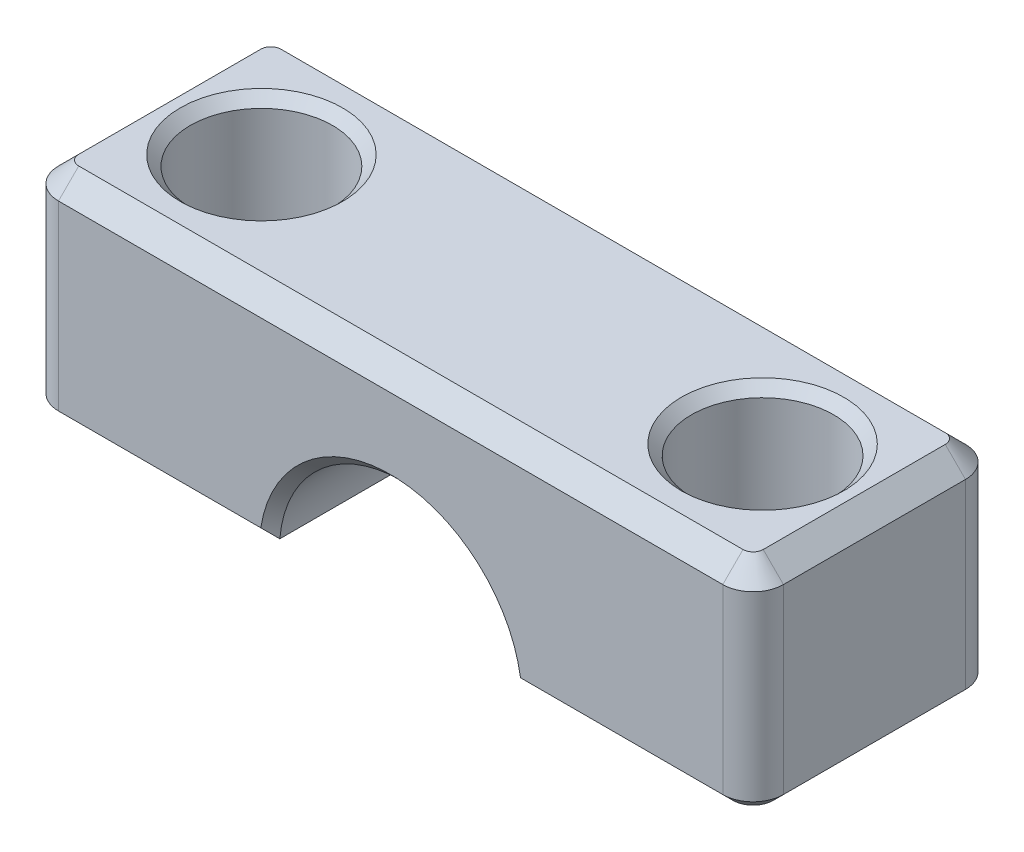
ISO-10303-21;
HEADER;
FILE_DESCRIPTION(('STEP AP214'),'2;1');
FILE_NAME('part.step','',(''),(''),'','','');
FILE_SCHEMA(('AUTOMOTIVE_DESIGN { 1 0 10303 214 1 1 1 1 }'));
ENDSEC;
DATA;
#1=APPLICATION_CONTEXT('core data for automotive mechanical design processes');
#2=APPLICATION_PROTOCOL_DEFINITION('international standard','automotive_design',2000,#1);
#3=PRODUCT_CONTEXT('',#1,'mechanical');
#4=PRODUCT('Part','Part','',(#3));
#5=PRODUCT_RELATED_PRODUCT_CATEGORY('part','',(#4));
#6=PRODUCT_DEFINITION_FORMATION('','',#4);
#7=PRODUCT_DEFINITION_CONTEXT('part definition',#1,'design');
#8=PRODUCT_DEFINITION('design','',#6,#7);
#9=PRODUCT_DEFINITION_SHAPE('','',#8);
#10=(LENGTH_UNIT() NAMED_UNIT(*) SI_UNIT(.MILLI.,.METRE.));
#11=(NAMED_UNIT(*) PLANE_ANGLE_UNIT() SI_UNIT($,.RADIAN.));
#12=(NAMED_UNIT(*) SI_UNIT($,.STERADIAN.) SOLID_ANGLE_UNIT());
#13=UNCERTAINTY_MEASURE_WITH_UNIT(LENGTH_MEASURE(1.E-05),#10,'distance_accuracy_value','');
#14=(GEOMETRIC_REPRESENTATION_CONTEXT(3) GLOBAL_UNCERTAINTY_ASSIGNED_CONTEXT((#13)) GLOBAL_UNIT_ASSIGNED_CONTEXT((#10,
#11,#12)) REPRESENTATION_CONTEXT('',''));
#15=CARTESIAN_POINT('',(0.,0.,0.));
#16=DIRECTION('',(0.,0.,1.));
#17=DIRECTION('',(1.,0.,0.));
#18=AXIS2_PLACEMENT_3D('',#15,#16,#17);
#19=CARTESIAN_POINT('',(-12.388,0.,-6.));
#20=DIRECTION('',(0.,1.,0.));
#21=DIRECTION('',(-1.,0.,0.));
#22=AXIS2_PLACEMENT_3D('',#19,#20,#21);
#23=CYLINDRICAL_SURFACE('',#22,2.254);
#24=CARTESIAN_POINT('',(-12.388,14.945,-6.));
#25=DIRECTION('',(0.,1.,0.));
#26=DIRECTION('',(0.,0.,1.));
#27=AXIS2_PLACEMENT_3D('',#24,#25,#26);
#28=CIRCLE('',#27,2.254);
#29=CARTESIAN_POINT('',(-12.388,14.945,-3.746));
#30=VERTEX_POINT('',#29);
#31=EDGE_CURVE('E238',#30,#30,#28,.T.);
#32=ORIENTED_EDGE('',*,*,#31,.T.);
#33=EDGE_LOOP('',(#32));
#34=FACE_BOUND('',#33,.T.);
#35=CARTESIAN_POINT('',(-12.388,11.968,-6.));
#36=DIRECTION('',(0.,-1.,0.));
#37=DIRECTION('',(1.,0.,0.));
#38=AXIS2_PLACEMENT_3D('',#35,#36,#37);
#39=CIRCLE('',#38,2.254);
#40=CARTESIAN_POINT('',(-10.134,11.968,-6.));
#41=VERTEX_POINT('',#40);
#42=EDGE_CURVE('E448',#41,#41,#39,.T.);
#43=ORIENTED_EDGE('',*,*,#42,.T.);
#44=EDGE_LOOP('',(#43));
#45=FACE_BOUND('',#44,.T.);
#46=ADVANCED_FACE('F41',(#34,#45),#23,.F.);
#47=CARTESIAN_POINT('',(-17.92,11.968,-12.));
#48=DIRECTION('',(-1.,0.,0.));
#49=DIRECTION('',(0.,0.,1.));
#50=AXIS2_PLACEMENT_3D('',#47,#48,#49);
#51=PLANE('',#50);
#52=DIRECTION('',(0.,-1.,0.));
#53=VECTOR('',#52,1.);
#54=CARTESIAN_POINT('',(-17.92,11.968,-10.5));
#55=LINE('',#54,#53);
#56=CARTESIAN_POINT('',(-17.92,21.46,-10.5));
#57=VERTEX_POINT('',#56);
#58=CARTESIAN_POINT('',(-17.92,12.468,-10.5));
#59=VERTEX_POINT('',#58);
#60=EDGE_CURVE('E440',#57,#59,#55,.T.);
#61=ORIENTED_EDGE('',*,*,#60,.T.);
#62=DIRECTION('',(0.,0.,1.));
#63=VECTOR('',#62,1.);
#64=CARTESIAN_POINT('',(-17.92,12.468,-12.));
#65=LINE('',#64,#63);
#66=CARTESIAN_POINT('',(-17.92,12.468,-1.5));
#67=VERTEX_POINT('',#66);
#68=EDGE_CURVE('E280',#59,#67,#65,.T.);
#69=ORIENTED_EDGE('',*,*,#68,.T.);
#70=DIRECTION('',(0.,-1.,0.));
#71=VECTOR('',#70,1.);
#72=CARTESIAN_POINT('',(-17.92,11.968,-1.5));
#73=LINE('',#72,#71);
#74=CARTESIAN_POINT('',(-17.92,21.46,-1.5));
#75=VERTEX_POINT('',#74);
#76=EDGE_CURVE('E438',#67,#75,#73,.F.);
#77=ORIENTED_EDGE('',*,*,#76,.T.);
#78=DIRECTION('',(0.,0.,-1.));
#79=VECTOR('',#78,1.);
#80=CARTESIAN_POINT('',(-17.92,21.46,-12.));
#81=LINE('',#80,#79);
#82=EDGE_CURVE('E487',#75,#57,#81,.T.);
#83=ORIENTED_EDGE('',*,*,#82,.T.);
#84=EDGE_LOOP('',(#61,#69,#77,#83));
#85=FACE_BOUND('',#84,.T.);
#86=ADVANCED_FACE('F510',(#85),#51,.T.);
#87=CARTESIAN_POINT('',(-17.92,22.46,-12.));
#88=DIRECTION('',(0.,1.,0.));
#89=DIRECTION('',(-1.,0.,0.));
#90=AXIS2_PLACEMENT_3D('',#87,#88,#89);
#91=PLANE('',#90);
#92=CARTESIAN_POINT('',(12.388,22.46,-6.));
#93=DIRECTION('',(0.,1.,0.));
#94=DIRECTION('',(-1.,0.,0.));
#95=AXIS2_PLACEMENT_3D('',#92,#93,#94);
#96=CIRCLE('',#95,4.01249999999999);
#97=CARTESIAN_POINT('',(8.37550000000002,22.46,-6.));
#98=VERTEX_POINT('',#97);
#99=EDGE_CURVE('E232',#98,#98,#96,.F.);
#100=ORIENTED_EDGE('',*,*,#99,.T.);
#101=EDGE_LOOP('',(#100));
#102=FACE_BOUND('',#101,.T.);
#103=CARTESIAN_POINT('',(-12.388,22.46,-6.));
#104=DIRECTION('',(0.,1.,0.));
#105=DIRECTION('',(-1.,0.,0.));
#106=AXIS2_PLACEMENT_3D('',#103,#104,#105);
#107=CIRCLE('',#106,4.01250000000001);
#108=CARTESIAN_POINT('',(-16.4005,22.46,-6.));
#109=VERTEX_POINT('',#108);
#110=EDGE_CURVE('E229',#109,#109,#107,.F.);
#111=ORIENTED_EDGE('',*,*,#110,.T.);
#112=EDGE_LOOP('',(#111));
#113=FACE_BOUND('',#112,.T.);
#114=CARTESIAN_POINT('',(16.42,22.46,-10.5));
#115=DIRECTION('',(0.,1.,0.));
#116=DIRECTION('',(-1.,0.,0.));
#117=AXIS2_PLACEMENT_3D('',#114,#115,#116);
#118=CIRCLE('',#117,0.5);
#119=CARTESIAN_POINT('',(16.92,22.46,-10.5));
#120=VERTEX_POINT('',#119);
#121=CARTESIAN_POINT('',(16.42,22.46,-11.));
#122=VERTEX_POINT('',#121);
#123=EDGE_CURVE('E472',#120,#122,#118,.T.);
#124=ORIENTED_EDGE('',*,*,#123,.T.);
#125=DIRECTION('',(-1.,0.,0.));
#126=VECTOR('',#125,1.);
#127=CARTESIAN_POINT('',(-16.42,22.46,-11.));
#128=LINE('',#127,#126);
#129=CARTESIAN_POINT('',(-16.42,22.46,-11.));
#130=VERTEX_POINT('',#129);
#131=EDGE_CURVE('E474',#122,#130,#128,.T.);
#132=ORIENTED_EDGE('',*,*,#131,.T.);
#133=CARTESIAN_POINT('',(-16.42,22.46,-10.5));
#134=DIRECTION('',(0.,1.,0.));
#135=DIRECTION('',(-1.,0.,0.));
#136=AXIS2_PLACEMENT_3D('',#133,#134,#135);
#137=CIRCLE('',#136,0.5);
#138=CARTESIAN_POINT('',(-16.92,22.46,-10.5));
#139=VERTEX_POINT('',#138);
#140=EDGE_CURVE('E470',#130,#139,#137,.T.);
#141=ORIENTED_EDGE('',*,*,#140,.T.);
#142=DIRECTION('',(0.,0.,1.));
#143=VECTOR('',#142,1.);
#144=CARTESIAN_POINT('',(-16.92,22.46,-12.));
#145=LINE('',#144,#143);
#146=CARTESIAN_POINT('',(-16.92,22.46,-1.5));
#147=VERTEX_POINT('',#146);
#148=EDGE_CURVE('E189',#139,#147,#145,.T.);
#149=ORIENTED_EDGE('',*,*,#148,.T.);
#150=CARTESIAN_POINT('',(-16.42,22.46,-1.5));
#151=DIRECTION('',(0.,1.,0.));
#152=DIRECTION('',(-1.,0.,0.));
#153=AXIS2_PLACEMENT_3D('',#150,#151,#152);
#154=CIRCLE('',#153,0.5);
#155=CARTESIAN_POINT('',(-16.42,22.46,-1.));
#156=VERTEX_POINT('',#155);
#157=EDGE_CURVE('E183',#147,#156,#154,.T.);
#158=ORIENTED_EDGE('',*,*,#157,.T.);
#159=DIRECTION('',(1.,0.,0.));
#160=VECTOR('',#159,1.);
#161=CARTESIAN_POINT('',(-17.92,22.46,-1.));
#162=LINE('',#161,#160);
#163=CARTESIAN_POINT('',(16.42,22.46,-1.));
#164=VERTEX_POINT('',#163);
#165=EDGE_CURVE('E186',#156,#164,#162,.T.);
#166=ORIENTED_EDGE('',*,*,#165,.T.);
#167=CARTESIAN_POINT('',(16.42,22.46,-1.5));
#168=DIRECTION('',(0.,1.,0.));
#169=DIRECTION('',(-1.,0.,0.));
#170=AXIS2_PLACEMENT_3D('',#167,#168,#169);
#171=CIRCLE('',#170,0.5);
#172=CARTESIAN_POINT('',(16.92,22.46,-1.5));
#173=VERTEX_POINT('',#172);
#174=EDGE_CURVE('E194',#164,#173,#171,.T.);
#175=ORIENTED_EDGE('',*,*,#174,.T.);
#176=DIRECTION('',(0.,0.,-1.));
#177=VECTOR('',#176,1.);
#178=CARTESIAN_POINT('',(16.92,22.46,-12.));
#179=LINE('',#178,#177);
#180=EDGE_CURVE('E468',#173,#120,#179,.T.);
#181=ORIENTED_EDGE('',*,*,#180,.T.);
#182=EDGE_LOOP('',(#124,#132,#141,#149,#158,#166,#175,#181));
#183=FACE_BOUND('',#182,.T.);
#184=ADVANCED_FACE('F185',(#102,#113,#183),#91,.T.);
#185=CARTESIAN_POINT('',(17.92,11.968,-12.));
#186=DIRECTION('',(1.,0.,0.));
#187=DIRECTION('',(0.,0.,-1.));
#188=AXIS2_PLACEMENT_3D('',#185,#186,#187);
#189=PLANE('',#188);
#190=DIRECTION('',(0.,1.,0.));
#191=VECTOR('',#190,1.);
#192=CARTESIAN_POINT('',(17.92,11.968,-1.5));
#193=LINE('',#192,#191);
#194=CARTESIAN_POINT('',(17.92,21.46,-1.5));
#195=VERTEX_POINT('',#194);
#196=CARTESIAN_POINT('',(17.92,12.468,-1.5));
#197=VERTEX_POINT('',#196);
#198=EDGE_CURVE('E462',#195,#197,#193,.F.);
#199=ORIENTED_EDGE('',*,*,#198,.T.);
#200=DIRECTION('',(0.,0.,-1.));
#201=VECTOR('',#200,1.);
#202=CARTESIAN_POINT('',(17.92,12.468,-12.));
#203=LINE('',#202,#201);
#204=CARTESIAN_POINT('',(17.92,12.468,-10.5));
#205=VERTEX_POINT('',#204);
#206=EDGE_CURVE('E282',#197,#205,#203,.T.);
#207=ORIENTED_EDGE('',*,*,#206,.T.);
#208=DIRECTION('',(0.,1.,0.));
#209=VECTOR('',#208,1.);
#210=CARTESIAN_POINT('',(17.92,22.46,-10.5));
#211=LINE('',#210,#209);
#212=CARTESIAN_POINT('',(17.92,21.46,-10.5));
#213=VERTEX_POINT('',#212);
#214=EDGE_CURVE('E205',#205,#213,#211,.T.);
#215=ORIENTED_EDGE('',*,*,#214,.T.);
#216=DIRECTION('',(0.,0.,1.));
#217=VECTOR('',#216,1.);
#218=CARTESIAN_POINT('',(17.92,21.46,-12.));
#219=LINE('',#218,#217);
#220=EDGE_CURVE('E485',#213,#195,#219,.T.);
#221=ORIENTED_EDGE('',*,*,#220,.T.);
#222=EDGE_LOOP('',(#199,#207,#215,#221));
#223=FACE_BOUND('',#222,.T.);
#224=ADVANCED_FACE('F592',(#223),#189,.T.);
#225=CARTESIAN_POINT('',(5.97845598796211,11.968,-12.));
#226=DIRECTION('',(0.,-1.,0.));
#227=DIRECTION('',(1.,0.,0.));
#228=AXIS2_PLACEMENT_3D('',#225,#226,#227);
#229=PLANE('',#228);
#230=CARTESIAN_POINT('',(12.388,11.968,-6.));
#231=DIRECTION('',(0.,-1.,0.));
#232=DIRECTION('',(1.,0.,0.));
#233=AXIS2_PLACEMENT_3D('',#230,#231,#232);
#234=CIRCLE('',#233,2.254);
#235=CARTESIAN_POINT('',(14.642,11.968,-6.));
#236=VERTEX_POINT('',#235);
#237=EDGE_CURVE('E442',#236,#236,#234,.T.);
#238=ORIENTED_EDGE('',*,*,#237,.F.);
#239=EDGE_LOOP('',(#238));
#240=FACE_BOUND('',#239,.T.);
#241=DIRECTION('',(0.,0.,1.));
#242=VECTOR('',#241,1.);
#243=CARTESIAN_POINT('',(5.97845598796211,11.968,-12.));
#244=LINE('',#243,#242);
#245=CARTESIAN_POINT('',(5.97845598796211,11.968,-11.5));
#246=VERTEX_POINT('',#245);
#247=CARTESIAN_POINT('',(5.97845598796211,11.968,-0.500000000000007));
#248=VERTEX_POINT('',#247);
#249=EDGE_CURVE('E432',#246,#248,#244,.T.);
#250=ORIENTED_EDGE('',*,*,#249,.F.);
#251=DIRECTION('',(1.,0.,0.));
#252=VECTOR('',#251,1.);
#253=CARTESIAN_POINT('',(16.42,11.968,-11.5));
#254=LINE('',#253,#252);
#255=CARTESIAN_POINT('',(16.42,11.968,-11.5));
#256=VERTEX_POINT('',#255);
#257=EDGE_CURVE('E274',#246,#256,#254,.T.);
#258=ORIENTED_EDGE('',*,*,#257,.T.);
#259=CARTESIAN_POINT('',(16.42,11.968,-10.5));
#260=DIRECTION('',(0.,-1.,0.));
#261=DIRECTION('',(1.,0.,0.));
#262=AXIS2_PLACEMENT_3D('',#259,#260,#261);
#263=CIRCLE('',#262,0.999999999999994);
#264=CARTESIAN_POINT('',(17.42,11.968,-10.5));
#265=VERTEX_POINT('',#264);
#266=EDGE_CURVE('E272',#256,#265,#263,.T.);
#267=ORIENTED_EDGE('',*,*,#266,.T.);
#268=DIRECTION('',(0.,0.,1.));
#269=VECTOR('',#268,1.);
#270=CARTESIAN_POINT('',(17.42,11.968,-12.));
#271=LINE('',#270,#269);
#272=CARTESIAN_POINT('',(17.42,11.968,-1.5));
#273=VERTEX_POINT('',#272);
#274=EDGE_CURVE('E270',#265,#273,#271,.T.);
#275=ORIENTED_EDGE('',*,*,#274,.T.);
#276=CARTESIAN_POINT('',(16.42,11.968,-1.5));
#277=DIRECTION('',(0.,-1.,0.));
#278=DIRECTION('',(1.,0.,0.));
#279=AXIS2_PLACEMENT_3D('',#276,#277,#278);
#280=CIRCLE('',#279,0.999999999999994);
#281=CARTESIAN_POINT('',(16.42,11.968,-0.500000000000007));
#282=VERTEX_POINT('',#281);
#283=EDGE_CURVE('E268',#273,#282,#280,.T.);
#284=ORIENTED_EDGE('',*,*,#283,.T.);
#285=DIRECTION('',(-1.,0.,0.));
#286=VECTOR('',#285,1.);
#287=CARTESIAN_POINT('',(5.97845598796211,11.968,-0.500000000000007));
#288=LINE('',#287,#286);
#289=EDGE_CURVE('E266',#282,#248,#288,.T.);
#290=ORIENTED_EDGE('',*,*,#289,.T.);
#291=EDGE_LOOP('',(#250,#258,#267,#275,#284,#290));
#292=FACE_BOUND('',#291,.T.);
#293=ADVANCED_FACE('F436',(#240,#292),#229,.T.);
#294=CARTESIAN_POINT('',(0.,11.46,-12.));
#295=DIRECTION('',(0.,0.,1.));
#296=DIRECTION('',(1.,0.,0.));
#297=AXIS2_PLACEMENT_3D('',#294,#295,#296);
#298=CYLINDRICAL_SURFACE('',#297,6.);
#299=DIRECTION('',(0.,0.,1.));
#300=VECTOR('',#299,1.);
#301=CARTESIAN_POINT('',(-5.97845598796211,11.968,-12.));
#302=LINE('',#301,#300);
#303=CARTESIAN_POINT('',(-5.97845598796211,11.968,-11.5));
#304=VERTEX_POINT('',#303);
#305=CARTESIAN_POINT('',(-5.97845598796211,11.968,-0.500000000000007));
#306=VERTEX_POINT('',#305);
#307=EDGE_CURVE('E435',#304,#306,#302,.T.);
#308=ORIENTED_EDGE('',*,*,#307,.F.);
#309=CARTESIAN_POINT('',(0.,11.46,-11.5));
#310=DIRECTION('',(0.,0.,1.));
#311=DIRECTION('',(1.,0.,0.));
#312=AXIS2_PLACEMENT_3D('',#309,#310,#311);
#313=CIRCLE('',#312,6.);
#314=EDGE_CURVE('E246',#304,#246,#313,.F.);
#315=ORIENTED_EDGE('',*,*,#314,.T.);
#316=ORIENTED_EDGE('',*,*,#249,.T.);
#317=CARTESIAN_POINT('',(0.,11.46,-0.500000000000007));
#318=DIRECTION('',(0.,0.,1.));
#319=DIRECTION('',(1.,0.,0.));
#320=AXIS2_PLACEMENT_3D('',#317,#318,#319);
#321=CIRCLE('',#320,6.);
#322=EDGE_CURVE('E244',#248,#306,#321,.T.);
#323=ORIENTED_EDGE('',*,*,#322,.T.);
#324=EDGE_LOOP('',(#308,#315,#316,#323));
#325=FACE_BOUND('',#324,.T.);
#326=ADVANCED_FACE('F431',(#325),#298,.F.);
#327=CARTESIAN_POINT('',(-17.92,11.968,-12.));
#328=DIRECTION('',(0.,-1.,0.));
#329=DIRECTION('',(1.,0.,0.));
#330=AXIS2_PLACEMENT_3D('',#327,#328,#329);
#331=PLANE('',#330);
#332=ORIENTED_EDGE('',*,*,#42,.F.);
#333=EDGE_LOOP('',(#332));
#334=FACE_BOUND('',#333,.T.);
#335=CARTESIAN_POINT('',(-16.42,11.968,-10.5));
#336=DIRECTION('',(0.,-1.,0.));
#337=DIRECTION('',(1.,0.,0.));
#338=AXIS2_PLACEMENT_3D('',#335,#336,#337);
#339=CIRCLE('',#338,0.999999999999994);
#340=CARTESIAN_POINT('',(-17.42,11.968,-10.5));
#341=VERTEX_POINT('',#340);
#342=CARTESIAN_POINT('',(-16.42,11.968,-11.5));
#343=VERTEX_POINT('',#342);
#344=EDGE_CURVE('E262',#341,#343,#339,.T.);
#345=ORIENTED_EDGE('',*,*,#344,.T.);
#346=DIRECTION('',(1.,0.,0.));
#347=VECTOR('',#346,1.);
#348=CARTESIAN_POINT('',(-5.97845598796211,11.968,-11.5));
#349=LINE('',#348,#347);
#350=EDGE_CURVE('E264',#343,#304,#349,.T.);
#351=ORIENTED_EDGE('',*,*,#350,.T.);
#352=ORIENTED_EDGE('',*,*,#307,.T.);
#353=DIRECTION('',(-1.,0.,0.));
#354=VECTOR('',#353,1.);
#355=CARTESIAN_POINT('',(-17.92,11.968,-0.500000000000007));
#356=LINE('',#355,#354);
#357=CARTESIAN_POINT('',(-16.42,11.968,-0.500000000000007));
#358=VERTEX_POINT('',#357);
#359=EDGE_CURVE('E256',#306,#358,#356,.T.);
#360=ORIENTED_EDGE('',*,*,#359,.T.);
#361=CARTESIAN_POINT('',(-16.42,11.968,-1.5));
#362=DIRECTION('',(0.,-1.,0.));
#363=DIRECTION('',(1.,0.,0.));
#364=AXIS2_PLACEMENT_3D('',#361,#362,#363);
#365=CIRCLE('',#364,0.999999999999994);
#366=CARTESIAN_POINT('',(-17.42,11.968,-1.5));
#367=VERTEX_POINT('',#366);
#368=EDGE_CURVE('E258',#358,#367,#365,.T.);
#369=ORIENTED_EDGE('',*,*,#368,.T.);
#370=DIRECTION('',(0.,0.,-1.));
#371=VECTOR('',#370,1.);
#372=CARTESIAN_POINT('',(-17.42,11.968,-12.));
#373=LINE('',#372,#371);
#374=EDGE_CURVE('E260',#367,#341,#373,.T.);
#375=ORIENTED_EDGE('',*,*,#374,.T.);
#376=EDGE_LOOP('',(#345,#351,#352,#360,#369,#375));
#377=FACE_BOUND('',#376,.T.);
#378=ADVANCED_FACE('F587',(#334,#377),#331,.T.);
#379=CARTESIAN_POINT('',(0.,11.46,-12.));
#380=DIRECTION('',(0.,0.,1.));
#381=DIRECTION('',(1.,0.,0.));
#382=AXIS2_PLACEMENT_3D('',#379,#380,#381);
#383=PLANE('',#382);
#384=CARTESIAN_POINT('',(0.,11.46,-12.));
#385=DIRECTION('',(0.,0.,1.));
#386=DIRECTION('',(1.,0.,0.));
#387=AXIS2_PLACEMENT_3D('',#384,#385,#386);
#388=CIRCLE('',#387,6.5);
#389=CARTESIAN_POINT('',(6.42136558685145,12.468,-12.));
#390=VERTEX_POINT('',#389);
#391=CARTESIAN_POINT('',(-6.42136558685145,12.468,-12.));
#392=VERTEX_POINT('',#391);
#393=EDGE_CURVE('E251',#390,#392,#388,.T.);
#394=ORIENTED_EDGE('',*,*,#393,.T.);
#395=DIRECTION('',(-1.,0.,0.));
#396=VECTOR('',#395,1.);
#397=CARTESIAN_POINT('',(-16.42,12.468,-12.));
#398=LINE('',#397,#396);
#399=CARTESIAN_POINT('',(-16.42,12.468,-12.));
#400=VERTEX_POINT('',#399);
#401=EDGE_CURVE('E254',#392,#400,#398,.T.);
#402=ORIENTED_EDGE('',*,*,#401,.T.);
#403=DIRECTION('',(0.,-1.,0.));
#404=VECTOR('',#403,1.);
#405=CARTESIAN_POINT('',(-16.42,22.46,-12.));
#406=LINE('',#405,#404);
#407=CARTESIAN_POINT('',(-16.42,21.46,-12.));
#408=VERTEX_POINT('',#407);
#409=EDGE_CURVE('E456',#400,#408,#406,.F.);
#410=ORIENTED_EDGE('',*,*,#409,.T.);
#411=DIRECTION('',(1.,0.,0.));
#412=VECTOR('',#411,1.);
#413=CARTESIAN_POINT('',(16.42,21.46,-12.));
#414=LINE('',#413,#412);
#415=CARTESIAN_POINT('',(16.42,21.46,-12.));
#416=VERTEX_POINT('',#415);
#417=EDGE_CURVE('E477',#408,#416,#414,.T.);
#418=ORIENTED_EDGE('',*,*,#417,.T.);
#419=DIRECTION('',(0.,1.,0.));
#420=VECTOR('',#419,1.);
#421=CARTESIAN_POINT('',(16.42,11.968,-12.));
#422=LINE('',#421,#420);
#423=CARTESIAN_POINT('',(16.42,12.468,-12.));
#424=VERTEX_POINT('',#423);
#425=EDGE_CURVE('E424',#416,#424,#422,.F.);
#426=ORIENTED_EDGE('',*,*,#425,.T.);
#427=DIRECTION('',(-1.,0.,0.));
#428=VECTOR('',#427,1.);
#429=CARTESIAN_POINT('',(5.97845598796211,12.468,-12.));
#430=LINE('',#429,#428);
#431=EDGE_CURVE('E249',#424,#390,#430,.T.);
#432=ORIENTED_EDGE('',*,*,#431,.T.);
#433=EDGE_LOOP('',(#394,#402,#410,#418,#426,#432));
#434=FACE_BOUND('',#433,.T.);
#435=ADVANCED_FACE('F420',(#434),#383,.F.);
#436=CARTESIAN_POINT('',(0.,11.46,0.));
#437=DIRECTION('',(0.,0.,1.));
#438=DIRECTION('',(1.,0.,0.));
#439=AXIS2_PLACEMENT_3D('',#436,#437,#438);
#440=PLANE('',#439);
#441=DIRECTION('',(0.,-1.,0.));
#442=VECTOR('',#441,1.);
#443=CARTESIAN_POINT('',(-16.42,11.46,0.));
#444=LINE('',#443,#442);
#445=CARTESIAN_POINT('',(-16.42,21.46,0.));
#446=VERTEX_POINT('',#445);
#447=CARTESIAN_POINT('',(-16.42,12.468,0.));
#448=VERTEX_POINT('',#447);
#449=EDGE_CURVE('E460',#446,#448,#444,.T.);
#450=ORIENTED_EDGE('',*,*,#449,.T.);
#451=DIRECTION('',(1.,0.,0.));
#452=VECTOR('',#451,1.);
#453=CARTESIAN_POINT('',(0.,12.468,0.));
#454=LINE('',#453,#452);
#455=CARTESIAN_POINT('',(-6.42136558685145,12.468,0.));
#456=VERTEX_POINT('',#455);
#457=EDGE_CURVE('E11',#448,#456,#454,.T.);
#458=ORIENTED_EDGE('',*,*,#457,.T.);
#459=CARTESIAN_POINT('',(0.,11.46,0.));
#460=DIRECTION('',(0.,0.,1.));
#461=DIRECTION('',(1.,0.,0.));
#462=AXIS2_PLACEMENT_3D('',#459,#460,#461);
#463=CIRCLE('',#462,6.5);
#464=CARTESIAN_POINT('',(6.42136558685145,12.468,0.));
#465=VERTEX_POINT('',#464);
#466=EDGE_CURVE('E64',#456,#465,#463,.F.);
#467=ORIENTED_EDGE('',*,*,#466,.T.);
#468=DIRECTION('',(1.,0.,0.));
#469=VECTOR('',#468,1.);
#470=CARTESIAN_POINT('',(0.,12.468,0.));
#471=LINE('',#470,#469);
#472=CARTESIAN_POINT('',(16.42,12.468,0.));
#473=VERTEX_POINT('',#472);
#474=EDGE_CURVE('E57',#465,#473,#471,.T.);
#475=ORIENTED_EDGE('',*,*,#474,.T.);
#476=DIRECTION('',(0.,1.,0.));
#477=VECTOR('',#476,1.);
#478=CARTESIAN_POINT('',(16.42,11.46,0.));
#479=LINE('',#478,#477);
#480=CARTESIAN_POINT('',(16.42,21.46,0.));
#481=VERTEX_POINT('',#480);
#482=EDGE_CURVE('E458',#473,#481,#479,.T.);
#483=ORIENTED_EDGE('',*,*,#482,.T.);
#484=DIRECTION('',(-1.,0.,0.));
#485=VECTOR('',#484,1.);
#486=CARTESIAN_POINT('',(0.,21.46,0.));
#487=LINE('',#486,#485);
#488=EDGE_CURVE('E223',#481,#446,#487,.T.);
#489=ORIENTED_EDGE('',*,*,#488,.T.);
#490=EDGE_LOOP('',(#450,#458,#467,#475,#483,#489));
#491=FACE_BOUND('',#490,.T.);
#492=ADVANCED_FACE('F536',(#491),#440,.T.);
#493=CARTESIAN_POINT('',(12.388,0.,-6.));
#494=DIRECTION('',(0.,1.,0.));
#495=DIRECTION('',(-1.,0.,0.));
#496=AXIS2_PLACEMENT_3D('',#493,#494,#495);
#497=CYLINDRICAL_SURFACE('',#496,2.254);
#498=CARTESIAN_POINT('',(12.388,14.945,-6.));
#499=DIRECTION('',(0.,-1.,0.));
#500=DIRECTION('',(0.,0.,-1.));
#501=AXIS2_PLACEMENT_3D('',#498,#499,#500);
#502=CIRCLE('',#501,2.254);
#503=CARTESIAN_POINT('',(12.388,14.945,-8.254));
#504=VERTEX_POINT('',#503);
#505=EDGE_CURVE('E219',#504,#504,#502,.F.);
#506=ORIENTED_EDGE('',*,*,#505,.T.);
#507=EDGE_LOOP('',(#506));
#508=FACE_BOUND('',#507,.T.);
#509=ORIENTED_EDGE('',*,*,#237,.T.);
#510=EDGE_LOOP('',(#509));
#511=FACE_BOUND('',#510,.T.);
#512=ADVANCED_FACE('F583',(#508,#511),#497,.F.);
#513=CARTESIAN_POINT('',(12.388,15.445,-6.));
#514=DIRECTION('',(0.,-1.,0.));
#515=DIRECTION('',(1.,0.,0.));
#516=AXIS2_PLACEMENT_3D('',#513,#514,#515);
#517=PLANE('',#516);
#518=CARTESIAN_POINT('',(12.388,15.445,-6.));
#519=DIRECTION('',(0.,-1.,0.));
#520=DIRECTION('',(1.,0.,0.));
#521=AXIS2_PLACEMENT_3D('',#518,#519,#520);
#522=CIRCLE('',#521,2.754);
#523=CARTESIAN_POINT('',(15.142,15.445,-6.));
#524=VERTEX_POINT('',#523);
#525=EDGE_CURVE('E222',#524,#524,#522,.T.);
#526=ORIENTED_EDGE('',*,*,#525,.T.);
#527=EDGE_LOOP('',(#526));
#528=FACE_BOUND('',#527,.T.);
#529=CARTESIAN_POINT('',(12.388,15.445,-6.));
#530=DIRECTION('',(0.,1.,0.));
#531=DIRECTION('',(1.,0.,0.));
#532=AXIS2_PLACEMENT_3D('',#529,#530,#531);
#533=CIRCLE('',#532,3.5125);
#534=CARTESIAN_POINT('',(15.9005,15.445,-6.));
#535=VERTEX_POINT('',#534);
#536=EDGE_CURVE('E445',#535,#535,#533,.T.);
#537=ORIENTED_EDGE('',*,*,#536,.T.);
#538=EDGE_LOOP('',(#537));
#539=FACE_BOUND('',#538,.T.);
#540=ADVANCED_FACE('F664',(#528,#539),#517,.F.);
#541=CARTESIAN_POINT('',(12.388,15.445,-6.));
#542=DIRECTION('',(0.,1.,0.));
#543=DIRECTION('',(-1.,0.,0.));
#544=AXIS2_PLACEMENT_3D('',#541,#542,#543);
#545=CYLINDRICAL_SURFACE('',#544,3.5125);
#546=CARTESIAN_POINT('',(12.388,21.96,-6.));
#547=DIRECTION('',(0.,1.,0.));
#548=DIRECTION('',(0.,0.,1.));
#549=AXIS2_PLACEMENT_3D('',#546,#547,#548);
#550=CIRCLE('',#549,3.5125);
#551=CARTESIAN_POINT('',(12.388,21.96,-2.4875));
#552=VERTEX_POINT('',#551);
#553=EDGE_CURVE('E226',#552,#552,#550,.T.);
#554=ORIENTED_EDGE('',*,*,#553,.T.);
#555=EDGE_LOOP('',(#554));
#556=FACE_BOUND('',#555,.T.);
#557=ORIENTED_EDGE('',*,*,#536,.F.);
#558=EDGE_LOOP('',(#557));
#559=FACE_BOUND('',#558,.T.);
#560=ADVANCED_FACE('F666',(#556,#559),#545,.F.);
#561=CARTESIAN_POINT('',(-12.388,15.445,-6.));
#562=DIRECTION('',(0.,1.,0.));
#563=DIRECTION('',(-1.,0.,0.));
#564=AXIS2_PLACEMENT_3D('',#561,#562,#563);
#565=PLANE('',#564);
#566=CARTESIAN_POINT('',(-12.388,15.445,-6.));
#567=DIRECTION('',(0.,1.,0.));
#568=DIRECTION('',(-1.,0.,0.));
#569=AXIS2_PLACEMENT_3D('',#566,#567,#568);
#570=CIRCLE('',#569,2.754);
#571=CARTESIAN_POINT('',(-15.142,15.445,-6.));
#572=VERTEX_POINT('',#571);
#573=EDGE_CURVE('E235',#572,#572,#570,.F.);
#574=ORIENTED_EDGE('',*,*,#573,.T.);
#575=EDGE_LOOP('',(#574));
#576=FACE_BOUND('',#575,.T.);
#577=CARTESIAN_POINT('',(-12.388,15.445,-6.));
#578=DIRECTION('',(0.,1.,0.));
#579=DIRECTION('',(-1.,0.,0.));
#580=AXIS2_PLACEMENT_3D('',#577,#578,#579);
#581=CIRCLE('',#580,3.5125);
#582=CARTESIAN_POINT('',(-15.9005,15.445,-6.));
#583=VERTEX_POINT('',#582);
#584=EDGE_CURVE('E212',#583,#583,#581,.T.);
#585=ORIENTED_EDGE('',*,*,#584,.T.);
#586=EDGE_LOOP('',(#585));
#587=FACE_BOUND('',#586,.T.);
#588=ADVANCED_FACE('F656',(#576,#587),#565,.T.);
#589=CARTESIAN_POINT('',(-12.388,15.445,-6.));
#590=DIRECTION('',(0.,1.,0.));
#591=DIRECTION('',(-1.,0.,0.));
#592=AXIS2_PLACEMENT_3D('',#589,#590,#591);
#593=CYLINDRICAL_SURFACE('',#592,3.5125);
#594=CARTESIAN_POINT('',(-12.388,21.96,-6.));
#595=DIRECTION('',(0.,1.,0.));
#596=DIRECTION('',(0.,0.,1.));
#597=AXIS2_PLACEMENT_3D('',#594,#595,#596);
#598=CIRCLE('',#597,3.5125);
#599=CARTESIAN_POINT('',(-12.388,21.96,-2.4875));
#600=VERTEX_POINT('',#599);
#601=EDGE_CURVE('E241',#600,#600,#598,.T.);
#602=ORIENTED_EDGE('',*,*,#601,.T.);
#603=EDGE_LOOP('',(#602));
#604=FACE_BOUND('',#603,.T.);
#605=ORIENTED_EDGE('',*,*,#584,.F.);
#606=EDGE_LOOP('',(#605));
#607=FACE_BOUND('',#606,.T.);
#608=ADVANCED_FACE('F607',(#604,#607),#593,.F.);
#609=CARTESIAN_POINT('',(-16.42,11.968,-10.5));
#610=DIRECTION('',(0.,1.,0.));
#611=DIRECTION('',(0.,0.,1.));
#612=AXIS2_PLACEMENT_3D('',#609,#610,#611);
#613=CYLINDRICAL_SURFACE('',#612,1.5);
#614=ORIENTED_EDGE('',*,*,#409,.F.);
#615=CARTESIAN_POINT('',(-16.42,12.468,-10.5));
#616=DIRECTION('',(0.,-1.,0.));
#617=DIRECTION('',(0.,0.,-1.));
#618=AXIS2_PLACEMENT_3D('',#615,#616,#617);
#619=CIRCLE('',#618,1.5);
#620=EDGE_CURVE('E276',#400,#59,#619,.F.);
#621=ORIENTED_EDGE('',*,*,#620,.T.);
#622=ORIENTED_EDGE('',*,*,#60,.F.);
#623=CARTESIAN_POINT('',(-16.42,21.46,-10.5));
#624=DIRECTION('',(0.,1.,0.));
#625=DIRECTION('',(0.,0.,1.));
#626=AXIS2_PLACEMENT_3D('',#623,#624,#625);
#627=CIRCLE('',#626,1.5);
#628=EDGE_CURVE('E482',#57,#408,#627,.F.);
#629=ORIENTED_EDGE('',*,*,#628,.T.);
#630=EDGE_LOOP('',(#614,#621,#622,#629));
#631=FACE_BOUND('',#630,.T.);
#632=ADVANCED_FACE('F514',(#631),#613,.T.);
#633=CARTESIAN_POINT('',(-16.42,11.46,-1.5));
#634=DIRECTION('',(0.,-1.,0.));
#635=DIRECTION('',(0.,0.,-1.));
#636=AXIS2_PLACEMENT_3D('',#633,#634,#635);
#637=CYLINDRICAL_SURFACE('',#636,1.5);
#638=ORIENTED_EDGE('',*,*,#76,.F.);
#639=CARTESIAN_POINT('',(-16.42,12.468,-1.5));
#640=DIRECTION('',(0.,-1.,0.));
#641=DIRECTION('',(0.,0.,-1.));
#642=AXIS2_PLACEMENT_3D('',#639,#640,#641);
#643=CIRCLE('',#642,1.5);
#644=EDGE_CURVE('E284',#67,#448,#643,.F.);
#645=ORIENTED_EDGE('',*,*,#644,.T.);
#646=ORIENTED_EDGE('',*,*,#449,.F.);
#647=CARTESIAN_POINT('',(-16.42,21.46,-1.5));
#648=DIRECTION('',(0.,1.,0.));
#649=DIRECTION('',(0.,0.,1.));
#650=AXIS2_PLACEMENT_3D('',#647,#648,#649);
#651=CIRCLE('',#650,1.5);
#652=EDGE_CURVE('E209',#446,#75,#651,.F.);
#653=ORIENTED_EDGE('',*,*,#652,.T.);
#654=EDGE_LOOP('',(#638,#645,#646,#653));
#655=FACE_BOUND('',#654,.T.);
#656=ADVANCED_FACE('F523',(#655),#637,.T.);
#657=CARTESIAN_POINT('',(16.42,11.968,-10.5));
#658=DIRECTION('',(0.,-1.,0.));
#659=DIRECTION('',(0.,0.,-1.));
#660=AXIS2_PLACEMENT_3D('',#657,#658,#659);
#661=CYLINDRICAL_SURFACE('',#660,1.5);
#662=ORIENTED_EDGE('',*,*,#214,.F.);
#663=CARTESIAN_POINT('',(16.42,12.468,-10.5));
#664=DIRECTION('',(0.,-1.,0.));
#665=DIRECTION('',(0.,0.,-1.));
#666=AXIS2_PLACEMENT_3D('',#663,#664,#665);
#667=CIRCLE('',#666,1.5);
#668=EDGE_CURVE('E278',#205,#424,#667,.F.);
#669=ORIENTED_EDGE('',*,*,#668,.T.);
#670=ORIENTED_EDGE('',*,*,#425,.F.);
#671=CARTESIAN_POINT('',(16.42,21.46,-10.5));
#672=DIRECTION('',(0.,1.,0.));
#673=DIRECTION('',(0.,0.,1.));
#674=AXIS2_PLACEMENT_3D('',#671,#672,#673);
#675=CIRCLE('',#674,1.5);
#676=EDGE_CURVE('E479',#416,#213,#675,.F.);
#677=ORIENTED_EDGE('',*,*,#676,.T.);
#678=EDGE_LOOP('',(#662,#669,#670,#677));
#679=FACE_BOUND('',#678,.T.);
#680=ADVANCED_FACE('F610',(#679),#661,.T.);
#681=CARTESIAN_POINT('',(16.42,11.46,-1.5));
#682=DIRECTION('',(0.,1.,0.));
#683=DIRECTION('',(0.,0.,1.));
#684=AXIS2_PLACEMENT_3D('',#681,#682,#683);
#685=CYLINDRICAL_SURFACE('',#684,1.5);
#686=ORIENTED_EDGE('',*,*,#482,.F.);
#687=CARTESIAN_POINT('',(16.42,12.468,-1.5));
#688=DIRECTION('',(0.,-1.,0.));
#689=DIRECTION('',(0.,0.,-1.));
#690=AXIS2_PLACEMENT_3D('',#687,#688,#689);
#691=CIRCLE('',#690,1.5);
#692=EDGE_CURVE('E286',#473,#197,#691,.F.);
#693=ORIENTED_EDGE('',*,*,#692,.T.);
#694=ORIENTED_EDGE('',*,*,#198,.F.);
#695=CARTESIAN_POINT('',(16.42,21.46,-1.5));
#696=DIRECTION('',(0.,1.,0.));
#697=DIRECTION('',(0.,0.,1.));
#698=AXIS2_PLACEMENT_3D('',#695,#696,#697);
#699=CIRCLE('',#698,1.5);
#700=EDGE_CURVE('E489',#195,#481,#699,.F.);
#701=ORIENTED_EDGE('',*,*,#700,.T.);
#702=EDGE_LOOP('',(#686,#693,#694,#701));
#703=FACE_BOUND('',#702,.T.);
#704=ADVANCED_FACE('F538',(#703),#685,.T.);
#705=CARTESIAN_POINT('',(0.,21.46,0.));
#706=DIRECTION('',(0.,-0.707106781186549,-0.707106781186546));
#707=DIRECTION('',(-1.,0.,0.));
#708=AXIS2_PLACEMENT_3D('',#705,#706,#707);
#709=PLANE('',#708);
#710=DIRECTION('',(0.,0.707106781186545,-0.70710678118655));
#711=VECTOR('',#710,1.);
#712=CARTESIAN_POINT('',(-16.42,21.46,0.));
#713=LINE('',#712,#711);
#714=EDGE_CURVE('E200',#446,#156,#713,.T.);
#715=ORIENTED_EDGE('',*,*,#714,.F.);
#716=ORIENTED_EDGE('',*,*,#488,.F.);
#717=DIRECTION('',(0.,-0.707106781186545,0.70710678118655));
#718=VECTOR('',#717,1.);
#719=CARTESIAN_POINT('',(16.42,22.46,-1.));
#720=LINE('',#719,#718);
#721=EDGE_CURVE('E203',#164,#481,#720,.T.);
#722=ORIENTED_EDGE('',*,*,#721,.F.);
#723=ORIENTED_EDGE('',*,*,#165,.F.);
#724=EDGE_LOOP('',(#715,#716,#722,#723));
#725=FACE_BOUND('',#724,.T.);
#726=ADVANCED_FACE('F198',(#725),#709,.F.);
#727=CARTESIAN_POINT('',(16.42,22.46,-1.5));
#728=DIRECTION('',(0.,-1.,0.));
#729=DIRECTION('',(0.,0.,-1.));
#730=AXIS2_PLACEMENT_3D('',#727,#728,#729);
#731=CONICAL_SURFACE('',#730,0.499999999999999,0.785398163397452);
#732=ORIENTED_EDGE('',*,*,#721,.T.);
#733=ORIENTED_EDGE('',*,*,#700,.F.);
#734=DIRECTION('',(0.70710678118655,-0.707106781186545,0.));
#735=VECTOR('',#734,1.);
#736=CARTESIAN_POINT('',(16.92,22.46,-1.5));
#737=LINE('',#736,#735);
#738=EDGE_CURVE('E210',#173,#195,#737,.T.);
#739=ORIENTED_EDGE('',*,*,#738,.F.);
#740=ORIENTED_EDGE('',*,*,#174,.F.);
#741=EDGE_LOOP('',(#732,#733,#739,#740));
#742=FACE_BOUND('',#741,.T.);
#743=ADVANCED_FACE('F543',(#742),#731,.T.);
#744=CARTESIAN_POINT('',(-16.42,22.46,-1.5));
#745=DIRECTION('',(0.,-1.,0.));
#746=DIRECTION('',(0.,0.,-1.));
#747=AXIS2_PLACEMENT_3D('',#744,#745,#746);
#748=CONICAL_SURFACE('',#747,0.5,0.785398163397451);
#749=ORIENTED_EDGE('',*,*,#714,.T.);
#750=ORIENTED_EDGE('',*,*,#157,.F.);
#751=DIRECTION('',(0.70710678118655,0.707106781186545,0.));
#752=VECTOR('',#751,1.);
#753=CARTESIAN_POINT('',(-17.92,21.46,-1.5));
#754=LINE('',#753,#752);
#755=EDGE_CURVE('E215',#75,#147,#754,.T.);
#756=ORIENTED_EDGE('',*,*,#755,.F.);
#757=ORIENTED_EDGE('',*,*,#652,.F.);
#758=EDGE_LOOP('',(#749,#750,#756,#757));
#759=FACE_BOUND('',#758,.T.);
#760=ADVANCED_FACE('F207',(#759),#748,.T.);
#761=CARTESIAN_POINT('',(17.92,21.46,-12.));
#762=DIRECTION('',(-0.707106781186545,-0.70710678118655,0.));
#763=DIRECTION('',(0.,0.,1.));
#764=AXIS2_PLACEMENT_3D('',#761,#762,#763);
#765=PLANE('',#764);
#766=ORIENTED_EDGE('',*,*,#738,.T.);
#767=ORIENTED_EDGE('',*,*,#220,.F.);
#768=DIRECTION('',(0.70710678118655,-0.707106781186545,0.));
#769=VECTOR('',#768,1.);
#770=CARTESIAN_POINT('',(16.92,22.46,-10.5));
#771=LINE('',#770,#769);
#772=EDGE_CURVE('E501',#120,#213,#771,.T.);
#773=ORIENTED_EDGE('',*,*,#772,.F.);
#774=ORIENTED_EDGE('',*,*,#180,.F.);
#775=EDGE_LOOP('',(#766,#767,#773,#774));
#776=FACE_BOUND('',#775,.T.);
#777=ADVANCED_FACE('F550',(#776),#765,.F.);
#778=CARTESIAN_POINT('',(-16.92,22.46,-12.));
#779=DIRECTION('',(0.707106781186545,-0.70710678118655,0.));
#780=DIRECTION('',(0.,0.,1.));
#781=AXIS2_PLACEMENT_3D('',#778,#779,#780);
#782=PLANE('',#781);
#783=ORIENTED_EDGE('',*,*,#755,.T.);
#784=ORIENTED_EDGE('',*,*,#148,.F.);
#785=DIRECTION('',(0.70710678118655,0.707106781186545,0.));
#786=VECTOR('',#785,1.);
#787=CARTESIAN_POINT('',(-17.92,21.46,-10.5));
#788=LINE('',#787,#786);
#789=EDGE_CURVE('E498',#57,#139,#788,.T.);
#790=ORIENTED_EDGE('',*,*,#789,.F.);
#791=ORIENTED_EDGE('',*,*,#82,.F.);
#792=EDGE_LOOP('',(#783,#784,#790,#791));
#793=FACE_BOUND('',#792,.T.);
#794=ADVANCED_FACE('F505',(#793),#782,.F.);
#795=CARTESIAN_POINT('',(16.42,22.46,-10.5));
#796=DIRECTION('',(0.,-1.,0.));
#797=DIRECTION('',(0.,0.,-1.));
#798=AXIS2_PLACEMENT_3D('',#795,#796,#797);
#799=CONICAL_SURFACE('',#798,0.5,0.785398163397451);
#800=ORIENTED_EDGE('',*,*,#772,.T.);
#801=ORIENTED_EDGE('',*,*,#676,.F.);
#802=DIRECTION('',(0.,-0.707106781186546,-0.707106781186549));
#803=VECTOR('',#802,1.);
#804=CARTESIAN_POINT('',(16.42,22.46,-11.));
#805=LINE('',#804,#803);
#806=EDGE_CURVE('E496',#122,#416,#805,.T.);
#807=ORIENTED_EDGE('',*,*,#806,.F.);
#808=ORIENTED_EDGE('',*,*,#123,.F.);
#809=EDGE_LOOP('',(#800,#801,#807,#808));
#810=FACE_BOUND('',#809,.T.);
#811=ADVANCED_FACE('F553',(#810),#799,.T.);
#812=CARTESIAN_POINT('',(-16.42,22.46,-10.5));
#813=DIRECTION('',(0.,-1.,0.));
#814=DIRECTION('',(0.,0.,-1.));
#815=AXIS2_PLACEMENT_3D('',#812,#813,#814);
#816=CONICAL_SURFACE('',#815,0.499999999999999,0.785398163397452);
#817=ORIENTED_EDGE('',*,*,#789,.T.);
#818=ORIENTED_EDGE('',*,*,#140,.F.);
#819=DIRECTION('',(0.,0.707106781186546,0.707106781186549));
#820=VECTOR('',#819,1.);
#821=CARTESIAN_POINT('',(-16.42,21.46,-12.));
#822=LINE('',#821,#820);
#823=EDGE_CURVE('E494',#408,#130,#822,.T.);
#824=ORIENTED_EDGE('',*,*,#823,.F.);
#825=ORIENTED_EDGE('',*,*,#628,.F.);
#826=EDGE_LOOP('',(#817,#818,#824,#825));
#827=FACE_BOUND('',#826,.T.);
#828=ADVANCED_FACE('F560',(#827),#816,.T.);
#829=CARTESIAN_POINT('',(-17.92,22.46,-11.));
#830=DIRECTION('',(0.,0.707106781186549,-0.707106781186546));
#831=DIRECTION('',(1.,0.,0.));
#832=AXIS2_PLACEMENT_3D('',#829,#830,#831);
#833=PLANE('',#832);
#834=ORIENTED_EDGE('',*,*,#806,.T.);
#835=ORIENTED_EDGE('',*,*,#417,.F.);
#836=ORIENTED_EDGE('',*,*,#823,.T.);
#837=ORIENTED_EDGE('',*,*,#131,.F.);
#838=EDGE_LOOP('',(#834,#835,#836,#837));
#839=FACE_BOUND('',#838,.T.);
#840=ADVANCED_FACE('F556',(#839),#833,.T.);
#841=CARTESIAN_POINT('',(12.388,14.945,-6.));
#842=DIRECTION('',(0.,1.,0.));
#843=DIRECTION('',(0.,0.,1.));
#844=AXIS2_PLACEMENT_3D('',#841,#842,#843);
#845=CONICAL_SURFACE('',#844,2.254,0.785398163397455);
#846=ORIENTED_EDGE('',*,*,#525,.F.);
#847=EDGE_LOOP('',(#846));
#848=FACE_BOUND('',#847,.T.);
#849=ORIENTED_EDGE('',*,*,#505,.F.);
#850=EDGE_LOOP('',(#849));
#851=FACE_BOUND('',#850,.T.);
#852=ADVANCED_FACE('F568',(#848,#851),#845,.F.);
#853=CARTESIAN_POINT('',(12.388,21.96,-6.));
#854=DIRECTION('',(0.,1.,0.));
#855=DIRECTION('',(0.,0.,1.));
#856=AXIS2_PLACEMENT_3D('',#853,#854,#855);
#857=CONICAL_SURFACE('',#856,3.5125,0.785398163397441);
#858=ORIENTED_EDGE('',*,*,#99,.F.);
#859=EDGE_LOOP('',(#858));
#860=FACE_BOUND('',#859,.T.);
#861=ORIENTED_EDGE('',*,*,#553,.F.);
#862=EDGE_LOOP('',(#861));
#863=FACE_BOUND('',#862,.T.);
#864=ADVANCED_FACE('F631',(#860,#863),#857,.F.);
#865=CARTESIAN_POINT('',(-12.388,15.445,-6.));
#866=DIRECTION('',(0.,1.,0.));
#867=DIRECTION('',(0.,0.,1.));
#868=AXIS2_PLACEMENT_3D('',#865,#866,#867);
#869=CONICAL_SURFACE('',#868,2.754,0.785398163397449);
#870=ORIENTED_EDGE('',*,*,#31,.F.);
#871=EDGE_LOOP('',(#870));
#872=FACE_BOUND('',#871,.T.);
#873=ORIENTED_EDGE('',*,*,#573,.F.);
#874=EDGE_LOOP('',(#873));
#875=FACE_BOUND('',#874,.T.);
#876=ADVANCED_FACE('F636',(#872,#875),#869,.F.);
#877=CARTESIAN_POINT('',(-12.388,21.96,-6.));
#878=DIRECTION('',(0.,1.,0.));
#879=DIRECTION('',(0.,0.,1.));
#880=AXIS2_PLACEMENT_3D('',#877,#878,#879);
#881=CONICAL_SURFACE('',#880,3.5125,0.785398163397448);
#882=ORIENTED_EDGE('',*,*,#110,.F.);
#883=EDGE_LOOP('',(#882));
#884=FACE_BOUND('',#883,.T.);
#885=ORIENTED_EDGE('',*,*,#601,.F.);
#886=EDGE_LOOP('',(#885));
#887=FACE_BOUND('',#886,.T.);
#888=ADVANCED_FACE('F374',(#884,#887),#881,.F.);
#889=CARTESIAN_POINT('',(0.,11.46,0.));
#890=DIRECTION('',(0.,0.,1.));
#891=DIRECTION('',(1.,0.,0.));
#892=AXIS2_PLACEMENT_3D('',#889,#890,#891);
#893=CONICAL_SURFACE('',#892,6.5,0.785398163397445);
#894=CARTESIAN_POINT('',(5.97845598796211,11.968,-0.500000000000007));
#895=CARTESIAN_POINT('',(6.01633462185948,12.0092340410146,-0.458765958985444));
#896=CARTESIAN_POINT('',(6.05396035639046,12.0505840736495,-0.417415926350485));
#897=CARTESIAN_POINT('',(6.12872002363067,12.1335021081113,-0.334497891888678));
#898=CARTESIAN_POINT('',(6.16585398792466,12.1750700956979,-0.292929904302076));
#899=CARTESIAN_POINT('',(6.23964876045699,12.258415084569,-0.209584915431008));
#900=CARTESIAN_POINT('',(6.27630957172495,12.3001920845128,-0.167807915487238));
#901=CARTESIAN_POINT('',(6.34917588220535,12.3839478893831,-0.0840521106169342));
#902=CARTESIAN_POINT('',(6.38538135187831,12.4259267071605,-0.0420732928395346));
#903=CARTESIAN_POINT('',(6.4213655868516,12.4679999999999,0.));
#904=B_SPLINE_CURVE_WITH_KNOTS('',3,(#894,#895,#896,#897,#898,#899,#900,#901,#902,#903),
.UNSPECIFIED.,.F.,.F.,(4,2,2,2,4),(0.,0.208607660617775,0.417201857439846,0.625794717958012,
0.834401041473554),.UNSPECIFIED.);
#905=EDGE_CURVE('E378',#465,#248,#904,.F.);
#906=ORIENTED_EDGE('',*,*,#905,.F.);
#907=ORIENTED_EDGE('',*,*,#466,.F.);
#908=CARTESIAN_POINT('',(-6.42136558685145,12.468,0.));
#909=CARTESIAN_POINT('',(-6.38538135187826,12.4259267071605,-0.0420732928395054));
#910=CARTESIAN_POINT('',(-6.34917588220533,12.3839478893831,-0.084052110616924));
#911=CARTESIAN_POINT('',(-6.27630957172497,12.3001920845128,-0.167807915487243));
#912=CARTESIAN_POINT('',(-6.23964876045699,12.258415084569,-0.209584915431009));
#913=CARTESIAN_POINT('',(-6.16585398792465,12.1750700956979,-0.292929904302073));
#914=CARTESIAN_POINT('',(-6.12872002363067,12.1335021081113,-0.334497891888673));
#915=CARTESIAN_POINT('',(-6.05396035639047,12.0505840736495,-0.417415926350488));
#916=CARTESIAN_POINT('',(-6.0163346218595,12.0092340410146,-0.458765958985454));
#917=CARTESIAN_POINT('',(-5.97845598796217,11.968,-0.500000000000033));
#918=B_SPLINE_CURVE_WITH_KNOTS('',3,(#908,#909,#910,#911,#912,#913,#914,#915,#916,#917),
.UNSPECIFIED.,.F.,.F.,(4,2,2,2,4),(0.,0.208606323515545,0.41719918403371,0.625793380855782,
0.834401041473557),.UNSPECIFIED.);
#919=EDGE_CURVE('E47',#306,#456,#918,.F.);
#920=ORIENTED_EDGE('',*,*,#919,.F.);
#921=ORIENTED_EDGE('',*,*,#322,.F.);
#922=EDGE_LOOP('',(#906,#907,#920,#921));
#923=FACE_BOUND('',#922,.T.);
#924=ADVANCED_FACE('F368',(#923),#893,.F.);
#925=CARTESIAN_POINT('',(0.,12.468,0.));
#926=DIRECTION('',(0.,0.707106781186549,-0.707106781186546));
#927=DIRECTION('',(1.,0.,0.));
#928=AXIS2_PLACEMENT_3D('',#925,#926,#927);
#929=PLANE('',#928);
#930=ORIENTED_EDGE('',*,*,#919,.T.);
#931=ORIENTED_EDGE('',*,*,#457,.F.);
#932=DIRECTION('',(0.,0.707106781186545,0.70710678118655));
#933=VECTOR('',#932,1.);
#934=CARTESIAN_POINT('',(-16.42,11.968,-0.500000000000007));
#935=LINE('',#934,#933);
#936=EDGE_CURVE('E385',#358,#448,#935,.T.);
#937=ORIENTED_EDGE('',*,*,#936,.F.);
#938=ORIENTED_EDGE('',*,*,#359,.F.);
#939=EDGE_LOOP('',(#930,#931,#937,#938));
#940=FACE_BOUND('',#939,.T.);
#941=ADVANCED_FACE('F44',(#940),#929,.F.);
#942=CARTESIAN_POINT('',(0.,12.468,0.));
#943=DIRECTION('',(0.,0.70710678118655,-0.707106781186545));
#944=DIRECTION('',(1.,0.,0.));
#945=AXIS2_PLACEMENT_3D('',#942,#943,#944);
#946=PLANE('',#945);
#947=ORIENTED_EDGE('',*,*,#905,.T.);
#948=ORIENTED_EDGE('',*,*,#289,.F.);
#949=DIRECTION('',(0.,-0.707106781186545,-0.70710678118655));
#950=VECTOR('',#949,1.);
#951=CARTESIAN_POINT('',(16.42,12.468,0.));
#952=LINE('',#951,#950);
#953=EDGE_CURVE('E388',#473,#282,#952,.T.);
#954=ORIENTED_EDGE('',*,*,#953,.F.);
#955=ORIENTED_EDGE('',*,*,#474,.F.);
#956=EDGE_LOOP('',(#947,#948,#954,#955));
#957=FACE_BOUND('',#956,.T.);
#958=ADVANCED_FACE('F366',(#957),#946,.F.);
#959=CARTESIAN_POINT('',(-16.42,11.968,-1.5));
#960=DIRECTION('',(0.,1.,0.));
#961=DIRECTION('',(0.,0.,1.));
#962=AXIS2_PLACEMENT_3D('',#959,#960,#961);
#963=CONICAL_SURFACE('',#962,0.999999999999994,0.785398163397451);
#964=ORIENTED_EDGE('',*,*,#936,.T.);
#965=ORIENTED_EDGE('',*,*,#644,.F.);
#966=DIRECTION('',(-0.70710678118655,0.707106781186545,0.));
#967=VECTOR('',#966,1.);
#968=CARTESIAN_POINT('',(-17.42,11.968,-1.5));
#969=LINE('',#968,#967);
#970=EDGE_CURVE('E391',#367,#67,#969,.T.);
#971=ORIENTED_EDGE('',*,*,#970,.F.);
#972=ORIENTED_EDGE('',*,*,#368,.F.);
#973=EDGE_LOOP('',(#964,#965,#971,#972));
#974=FACE_BOUND('',#973,.T.);
#975=ADVANCED_FACE('F360',(#974),#963,.T.);
#976=CARTESIAN_POINT('',(16.42,11.968,-1.5));
#977=DIRECTION('',(0.,1.,0.));
#978=DIRECTION('',(0.,0.,1.));
#979=AXIS2_PLACEMENT_3D('',#976,#977,#978);
#980=CONICAL_SURFACE('',#979,0.999999999999994,0.78539816339745);
#981=ORIENTED_EDGE('',*,*,#953,.T.);
#982=ORIENTED_EDGE('',*,*,#283,.F.);
#983=DIRECTION('',(-0.70710678118655,-0.707106781186545,0.));
#984=VECTOR('',#983,1.);
#985=CARTESIAN_POINT('',(17.92,12.468,-1.5));
#986=LINE('',#985,#984);
#987=EDGE_CURVE('E394',#197,#273,#986,.T.);
#988=ORIENTED_EDGE('',*,*,#987,.F.);
#989=ORIENTED_EDGE('',*,*,#692,.F.);
#990=EDGE_LOOP('',(#981,#982,#988,#989));
#991=FACE_BOUND('',#990,.T.);
#992=ADVANCED_FACE('F353',(#991),#980,.T.);
#993=CARTESIAN_POINT('',(-17.92,12.468,-12.));
#994=DIRECTION('',(0.707106781186545,0.70710678118655,0.));
#995=DIRECTION('',(0.,0.,1.));
#996=AXIS2_PLACEMENT_3D('',#993,#994,#995);
#997=PLANE('',#996);
#998=ORIENTED_EDGE('',*,*,#970,.T.);
#999=ORIENTED_EDGE('',*,*,#68,.F.);
#1000=DIRECTION('',(-0.70710678118655,0.707106781186545,0.));
#1001=VECTOR('',#1000,1.);
#1002=CARTESIAN_POINT('',(-17.42,11.968,-10.5));
#1003=LINE('',#1002,#1001);
#1004=EDGE_CURVE('E397',#341,#59,#1003,.T.);
#1005=ORIENTED_EDGE('',*,*,#1004,.F.);
#1006=ORIENTED_EDGE('',*,*,#374,.F.);
#1007=EDGE_LOOP('',(#998,#999,#1005,#1006));
#1008=FACE_BOUND('',#1007,.T.);
#1009=ADVANCED_FACE('F346',(#1008),#997,.F.);
#1010=CARTESIAN_POINT('',(17.42,11.968,-12.));
#1011=DIRECTION('',(-0.707106781186545,0.70710678118655,0.));
#1012=DIRECTION('',(0.,0.,1.));
#1013=AXIS2_PLACEMENT_3D('',#1010,#1011,#1012);
#1014=PLANE('',#1013);
#1015=ORIENTED_EDGE('',*,*,#987,.T.);
#1016=ORIENTED_EDGE('',*,*,#274,.F.);
#1017=DIRECTION('',(-0.70710678118655,-0.707106781186545,0.));
#1018=VECTOR('',#1017,1.);
#1019=CARTESIAN_POINT('',(17.92,12.468,-10.5));
#1020=LINE('',#1019,#1018);
#1021=EDGE_CURVE('E400',#205,#265,#1020,.T.);
#1022=ORIENTED_EDGE('',*,*,#1021,.F.);
#1023=ORIENTED_EDGE('',*,*,#206,.F.);
#1024=EDGE_LOOP('',(#1015,#1016,#1022,#1023));
#1025=FACE_BOUND('',#1024,.T.);
#1026=ADVANCED_FACE('F339',(#1025),#1014,.F.);
#1027=CARTESIAN_POINT('',(-16.42,11.968,-10.5));
#1028=DIRECTION('',(0.,1.,0.));
#1029=DIRECTION('',(0.,0.,1.));
#1030=AXIS2_PLACEMENT_3D('',#1027,#1028,#1029);
#1031=CONICAL_SURFACE('',#1030,0.999999999999994,0.78539816339745);
#1032=ORIENTED_EDGE('',*,*,#1004,.T.);
#1033=ORIENTED_EDGE('',*,*,#620,.F.);
#1034=DIRECTION('',(0.,0.707106781186546,-0.707106781186549));
#1035=VECTOR('',#1034,1.);
#1036=CARTESIAN_POINT('',(-16.42,11.968,-11.5));
#1037=LINE('',#1036,#1035);
#1038=EDGE_CURVE('E403',#343,#400,#1037,.T.);
#1039=ORIENTED_EDGE('',*,*,#1038,.F.);
#1040=ORIENTED_EDGE('',*,*,#344,.F.);
#1041=EDGE_LOOP('',(#1032,#1033,#1039,#1040));
#1042=FACE_BOUND('',#1041,.T.);
#1043=ADVANCED_FACE('F332',(#1042),#1031,.T.);
#1044=CARTESIAN_POINT('',(16.42,11.968,-10.5));
#1045=DIRECTION('',(0.,1.,0.));
#1046=DIRECTION('',(0.,0.,1.));
#1047=AXIS2_PLACEMENT_3D('',#1044,#1045,#1046);
#1048=CONICAL_SURFACE('',#1047,0.999999999999994,0.78539816339745);
#1049=ORIENTED_EDGE('',*,*,#1021,.T.);
#1050=ORIENTED_EDGE('',*,*,#266,.F.);
#1051=DIRECTION('',(0.,-0.707106781186546,0.707106781186549));
#1052=VECTOR('',#1051,1.);
#1053=CARTESIAN_POINT('',(16.42,12.468,-12.));
#1054=LINE('',#1053,#1052);
#1055=EDGE_CURVE('E405',#424,#256,#1054,.T.);
#1056=ORIENTED_EDGE('',*,*,#1055,.F.);
#1057=ORIENTED_EDGE('',*,*,#668,.F.);
#1058=EDGE_LOOP('',(#1049,#1050,#1056,#1057));
#1059=FACE_BOUND('',#1058,.T.);
#1060=ADVANCED_FACE('F325',(#1059),#1048,.T.);
#1061=CARTESIAN_POINT('',(-17.92,11.968,-11.5));
#1062=DIRECTION('',(0.,-0.707106781186549,-0.707106781186546));
#1063=DIRECTION('',(-1.,0.,0.));
#1064=AXIS2_PLACEMENT_3D('',#1061,#1062,#1063);
#1065=PLANE('',#1064);
#1066=ORIENTED_EDGE('',*,*,#1038,.T.);
#1067=ORIENTED_EDGE('',*,*,#401,.F.);
#1068=CARTESIAN_POINT('',(-6.42136558685145,12.468,-12.));
#1069=CARTESIAN_POINT('',(-6.38538135187826,12.4259267071605,-11.9579267071605));
#1070=CARTESIAN_POINT('',(-6.34917588220533,12.3839478893831,-11.9159478893831));
#1071=CARTESIAN_POINT('',(-6.27630957172497,12.3001920845128,-11.8321920845128));
#1072=CARTESIAN_POINT('',(-6.23964876045699,12.258415084569,-11.790415084569));
#1073=CARTESIAN_POINT('',(-6.16585398792465,12.1750700956979,-11.7070700956979));
#1074=CARTESIAN_POINT('',(-6.12872002363066,12.1335021081113,-11.6655021081113));
#1075=CARTESIAN_POINT('',(-6.05396035639047,12.0505840736495,-11.5825840736495));
#1076=CARTESIAN_POINT('',(-6.0163346218595,12.0092340410146,-11.5412340410145));
#1077=CARTESIAN_POINT('',(-5.97845598796216,11.968,-11.5));
#1078=B_SPLINE_CURVE_WITH_KNOTS('',3,(#1068,#1069,#1070,#1071,#1072,#1073,#1074,#1075,#1076,
#1077),.UNSPECIFIED.,.F.,.F.,(4,2,2,2,4),(0.,0.208606323515545,0.417199184033711,
0.625793380855782,0.834401041473559),.UNSPECIFIED.);
#1079=EDGE_CURVE('E298',#304,#392,#1078,.F.);
#1080=ORIENTED_EDGE('',*,*,#1079,.F.);
#1081=ORIENTED_EDGE('',*,*,#350,.F.);
#1082=EDGE_LOOP('',(#1066,#1067,#1080,#1081));
#1083=FACE_BOUND('',#1082,.T.);
#1084=ADVANCED_FACE('F317',(#1083),#1065,.T.);
#1085=CARTESIAN_POINT('',(5.97845598796211,11.968,-11.5));
#1086=DIRECTION('',(0.,-0.70710678118655,-0.707106781186545));
#1087=DIRECTION('',(-1.,0.,0.));
#1088=AXIS2_PLACEMENT_3D('',#1085,#1086,#1087);
#1089=PLANE('',#1088);
#1090=ORIENTED_EDGE('',*,*,#1055,.T.);
#1091=ORIENTED_EDGE('',*,*,#257,.F.);
#1092=CARTESIAN_POINT('',(5.97845598796211,11.968,-11.5));
#1093=CARTESIAN_POINT('',(6.01633462185947,12.0092340410146,-11.5412340410146));
#1094=CARTESIAN_POINT('',(6.05396035639046,12.0505840736495,-11.5825840736495));
#1095=CARTESIAN_POINT('',(6.12872002363067,12.1335021081113,-11.6655021081113));
#1096=CARTESIAN_POINT('',(6.16585398792465,12.1750700956979,-11.7070700956979));
#1097=CARTESIAN_POINT('',(6.23964876045698,12.258415084569,-11.790415084569));
#1098=CARTESIAN_POINT('',(6.27630957172495,12.3001920845128,-11.8321920845128));
#1099=CARTESIAN_POINT('',(6.34917588220535,12.3839478893831,-11.9159478893831));
#1100=CARTESIAN_POINT('',(6.38538135187831,12.4259267071605,-11.9579267071605));
#1101=CARTESIAN_POINT('',(6.4213655868516,12.4679999999999,-11.9999999999999));
#1102=B_SPLINE_CURVE_WITH_KNOTS('',3,(#1092,#1093,#1094,#1095,#1096,#1097,#1098,#1099,#1100,
#1101),.UNSPECIFIED.,.F.,.F.,(4,2,2,2,4),(0.,0.208607660617774,0.417201857439847,
0.625794717958013,0.834401041473554),.UNSPECIFIED.);
#1103=EDGE_CURVE('E290',#390,#246,#1102,.F.);
#1104=ORIENTED_EDGE('',*,*,#1103,.F.);
#1105=ORIENTED_EDGE('',*,*,#431,.F.);
#1106=EDGE_LOOP('',(#1090,#1091,#1104,#1105));
#1107=FACE_BOUND('',#1106,.T.);
#1108=ADVANCED_FACE('F306',(#1107),#1089,.T.);
#1109=CARTESIAN_POINT('',(0.,11.46,-11.5));
#1110=DIRECTION('',(0.,0.,-1.));
#1111=DIRECTION('',(-1.,0.,0.));
#1112=AXIS2_PLACEMENT_3D('',#1109,#1110,#1111);
#1113=CONICAL_SURFACE('',#1112,6.,0.785398163397455);
#1114=ORIENTED_EDGE('',*,*,#1079,.T.);
#1115=ORIENTED_EDGE('',*,*,#393,.F.);
#1116=ORIENTED_EDGE('',*,*,#1103,.T.);
#1117=ORIENTED_EDGE('',*,*,#314,.F.);
#1118=EDGE_LOOP('',(#1114,#1115,#1116,#1117));
#1119=FACE_BOUND('',#1118,.T.);
#1120=ADVANCED_FACE('F310',(#1119),#1113,.F.);
#1121=CLOSED_SHELL('',(#46,#86,#184,#224,#293,#326,#378,#435,#492,#512,#540,#560,#588,#608,#632,
#656,#680,#704,#726,#743,#760,#777,#794,#811,#828,#840,#852,#864,#876,#888,#924,#941,#958,#975,
#992,#1009,#1026,#1043,#1060,#1084,#1108,#1120));
#1122=MANIFOLD_SOLID_BREP('B2',#1121);
#1123=ADVANCED_BREP_SHAPE_REPRESENTATION('',(#18,#1122),#14);
#1124=SHAPE_DEFINITION_REPRESENTATION(#9,#1123);
ENDSEC;
END-ISO-10303-21;
